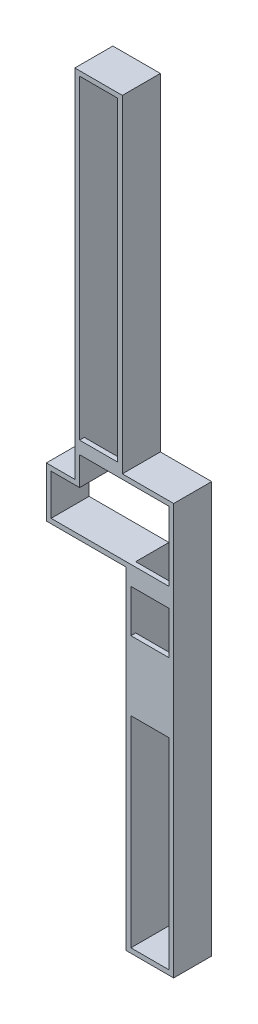
ISO-10303-21;
HEADER;
FILE_DESCRIPTION(('STEP AP214'),'2;1');
FILE_NAME('part.step','',(''),(''),'','','');
FILE_SCHEMA(('AUTOMOTIVE_DESIGN { 1 0 10303 214 1 1 1 1 }'));
ENDSEC;
DATA;
#1=APPLICATION_CONTEXT('core data for automotive mechanical design processes');
#2=APPLICATION_PROTOCOL_DEFINITION('international standard','automotive_design',2000,#1);
#3=PRODUCT_CONTEXT('',#1,'mechanical');
#4=PRODUCT('Part','Part','',(#3));
#5=PRODUCT_RELATED_PRODUCT_CATEGORY('part','',(#4));
#6=PRODUCT_DEFINITION_FORMATION('','',#4);
#7=PRODUCT_DEFINITION_CONTEXT('part definition',#1,'design');
#8=PRODUCT_DEFINITION('design','',#6,#7);
#9=PRODUCT_DEFINITION_SHAPE('','',#8);
#10=(LENGTH_UNIT() NAMED_UNIT(*) SI_UNIT(.MILLI.,.METRE.));
#11=(NAMED_UNIT(*) PLANE_ANGLE_UNIT() SI_UNIT($,.RADIAN.));
#12=(NAMED_UNIT(*) SI_UNIT($,.STERADIAN.) SOLID_ANGLE_UNIT());
#13=UNCERTAINTY_MEASURE_WITH_UNIT(LENGTH_MEASURE(1.E-05),#10,'distance_accuracy_value','');
#14=(GEOMETRIC_REPRESENTATION_CONTEXT(3) GLOBAL_UNCERTAINTY_ASSIGNED_CONTEXT((#13)) GLOBAL_UNIT_ASSIGNED_CONTEXT((#10,
#11,#12)) REPRESENTATION_CONTEXT('',''));
#15=CARTESIAN_POINT('',(0.,0.,0.));
#16=DIRECTION('',(0.,0.,1.));
#17=DIRECTION('',(1.,0.,0.));
#18=AXIS2_PLACEMENT_3D('',#15,#16,#17);
#19=CARTESIAN_POINT('',(0.,0.,800.));
#20=DIRECTION('',(0.,0.,1.));
#21=DIRECTION('',(1.,0.,0.));
#22=AXIS2_PLACEMENT_3D('',#19,#20,#21);
#23=PLANE('',#22);
#24=DIRECTION('',(0.,1.,0.));
#25=VECTOR('',#24,1.);
#26=CARTESIAN_POINT('',(526.453179541659,7500.,800.));
#27=LINE('',#26,#25);
#28=CARTESIAN_POINT('',(526.45317954166,865.,800.));
#29=VERTEX_POINT('',#28);
#30=CARTESIAN_POINT('',(526.453179541659,7500.,800.));
#31=VERTEX_POINT('',#30);
#32=EDGE_CURVE('E231',#29,#31,#27,.T.);
#33=ORIENTED_EDGE('',*,*,#32,.F.);
#34=DIRECTION('',(-1.,0.,0.));
#35=VECTOR('',#34,1.);
#36=CARTESIAN_POINT('',(-273.546820458341,865.,800.));
#37=LINE('',#36,#35);
#38=CARTESIAN_POINT('',(-273.546820458341,865.,800.));
#39=VERTEX_POINT('',#38);
#40=EDGE_CURVE('E235',#29,#39,#37,.T.);
#41=ORIENTED_EDGE('',*,*,#40,.T.);
#42=DIRECTION('',(0.,-1.,0.));
#43=VECTOR('',#42,1.);
#44=CARTESIAN_POINT('',(-273.546820458341,0.,800.));
#45=LINE('',#44,#43);
#46=CARTESIAN_POINT('',(-273.546820458341,7500.,800.));
#47=VERTEX_POINT('',#46);
#48=EDGE_CURVE('E331',#47,#39,#45,.T.);
#49=ORIENTED_EDGE('',*,*,#48,.F.);
#50=DIRECTION('',(-1.,0.,0.));
#51=VECTOR('',#50,1.);
#52=CARTESIAN_POINT('',(-273.546820458341,7500.,800.));
#53=LINE('',#52,#51);
#54=EDGE_CURVE('E237',#31,#47,#53,.T.);
#55=ORIENTED_EDGE('',*,*,#54,.F.);
#56=EDGE_LOOP('',(#33,#41,#49,#55));
#57=FACE_BOUND('',#56,.T.);
#58=DIRECTION('',(0.,-1.,0.));
#59=VECTOR('',#58,1.);
#60=CARTESIAN_POINT('',(806.45317954166,-860.,800.));
#61=LINE('',#60,#59);
#62=CARTESIAN_POINT('',(806.453179541661,-3618.33978235796,800.));
#63=VERTEX_POINT('',#62);
#64=CARTESIAN_POINT('',(806.453179541661,-7850.,800.));
#65=VERTEX_POINT('',#64);
#66=EDGE_CURVE('E319',#63,#65,#61,.T.);
#67=ORIENTED_EDGE('',*,*,#66,.F.);
#68=DIRECTION('',(1.,0.,0.));
#69=VECTOR('',#68,1.);
#70=CARTESIAN_POINT('',(1606.45317954166,-3618.33978235796,800.));
#71=LINE('',#70,#69);
#72=CARTESIAN_POINT('',(1606.45317954166,-3618.33978235797,800.));
#73=VERTEX_POINT('',#72);
#74=EDGE_CURVE('E260',#63,#73,#71,.T.);
#75=ORIENTED_EDGE('',*,*,#74,.T.);
#76=DIRECTION('',(0.,1.,0.));
#77=VECTOR('',#76,1.);
#78=CARTESIAN_POINT('',(1606.45317954166,-7850.,800.));
#79=LINE('',#78,#77);
#80=CARTESIAN_POINT('',(1606.45317954166,-7850.,800.));
#81=VERTEX_POINT('',#80);
#82=EDGE_CURVE('E325',#81,#73,#79,.T.);
#83=ORIENTED_EDGE('',*,*,#82,.F.);
#84=DIRECTION('',(1.,0.,0.));
#85=VECTOR('',#84,1.);
#86=CARTESIAN_POINT('',(806.453179541661,-7850.,800.));
#87=LINE('',#86,#85);
#88=EDGE_CURVE('E322',#65,#81,#87,.T.);
#89=ORIENTED_EDGE('',*,*,#88,.F.);
#90=EDGE_LOOP('',(#67,#75,#83,#89));
#91=FACE_BOUND('',#90,.T.);
#92=CARTESIAN_POINT('',(806.45317954166,-1260.,800.));
#93=VERTEX_POINT('',#92);
#94=CARTESIAN_POINT('',(806.45317954166,-2160.,800.));
#95=VERTEX_POINT('',#94);
#96=EDGE_CURVE('E320',#93,#95,#61,.T.);
#97=ORIENTED_EDGE('',*,*,#96,.F.);
#98=DIRECTION('',(1.,0.,0.));
#99=VECTOR('',#98,1.);
#100=CARTESIAN_POINT('',(1606.45317954166,-1260.,800.));
#101=LINE('',#100,#99);
#102=CARTESIAN_POINT('',(1606.45317954166,-1260.,800.));
#103=VERTEX_POINT('',#102);
#104=EDGE_CURVE('E281',#93,#103,#101,.T.);
#105=ORIENTED_EDGE('',*,*,#104,.T.);
#106=CARTESIAN_POINT('',(1606.45317954166,-2160.,800.));
#107=VERTEX_POINT('',#106);
#108=EDGE_CURVE('E327',#107,#103,#79,.T.);
#109=ORIENTED_EDGE('',*,*,#108,.F.);
#110=DIRECTION('',(-1.,0.,0.));
#111=VECTOR('',#110,1.);
#112=CARTESIAN_POINT('',(806.45317954166,-2160.,800.));
#113=LINE('',#112,#111);
#114=EDGE_CURVE('E265',#107,#95,#113,.T.);
#115=ORIENTED_EDGE('',*,*,#114,.T.);
#116=EDGE_LOOP('',(#97,#105,#109,#115));
#117=FACE_BOUND('',#116,.T.);
#118=DIRECTION('',(1.,0.,0.));
#119=VECTOR('',#118,1.);
#120=CARTESIAN_POINT('',(706.453179541661,-7950.,800.));
#121=LINE('',#120,#119);
#122=CARTESIAN_POINT('',(706.453179541661,-7950.,800.));
#123=VERTEX_POINT('',#122);
#124=CARTESIAN_POINT('',(1706.45317954166,-7950.,800.));
#125=VERTEX_POINT('',#124);
#126=EDGE_CURVE('E385',#123,#125,#121,.T.);
#127=ORIENTED_EDGE('',*,*,#126,.T.);
#128=DIRECTION('',(0.,1.,0.));
#129=VECTOR('',#128,1.);
#130=CARTESIAN_POINT('',(1706.45317954166,-7950.,800.));
#131=LINE('',#130,#129);
#132=CARTESIAN_POINT('',(1706.45317954166,700.,800.));
#133=VERTEX_POINT('',#132);
#134=EDGE_CURVE('E387',#125,#133,#131,.T.);
#135=ORIENTED_EDGE('',*,*,#134,.T.);
#136=DIRECTION('',(-1.,0.,0.));
#137=VECTOR('',#136,1.);
#138=CARTESIAN_POINT('',(1706.45317954166,700.,800.));
#139=LINE('',#138,#137);
#140=CARTESIAN_POINT('',(626.45317954166,700.,800.));
#141=VERTEX_POINT('',#140);
#142=EDGE_CURVE('E390',#133,#141,#139,.T.);
#143=ORIENTED_EDGE('',*,*,#142,.T.);
#144=DIRECTION('',(0.,1.,0.));
#145=VECTOR('',#144,1.);
#146=CARTESIAN_POINT('',(626.45317954166,700.,800.));
#147=LINE('',#146,#145);
#148=CARTESIAN_POINT('',(626.45317954166,7600.,800.));
#149=VERTEX_POINT('',#148);
#150=EDGE_CURVE('E392',#141,#149,#147,.T.);
#151=ORIENTED_EDGE('',*,*,#150,.T.);
#152=DIRECTION('',(-1.,0.,0.));
#153=VECTOR('',#152,1.);
#154=CARTESIAN_POINT('',(626.45317954166,7600.,800.));
#155=LINE('',#154,#153);
#156=CARTESIAN_POINT('',(-373.546820458341,7600.,800.));
#157=VERTEX_POINT('',#156);
#158=EDGE_CURVE('E394',#149,#157,#155,.T.);
#159=ORIENTED_EDGE('',*,*,#158,.T.);
#160=DIRECTION('',(0.,-1.,0.));
#161=VECTOR('',#160,1.);
#162=CARTESIAN_POINT('',(-373.546820458341,7600.,800.));
#163=LINE('',#162,#161);
#164=CARTESIAN_POINT('',(-373.54682045834,100.,800.));
#165=VERTEX_POINT('',#164);
#166=EDGE_CURVE('E396',#157,#165,#163,.T.);
#167=ORIENTED_EDGE('',*,*,#166,.T.);
#168=DIRECTION('',(-1.,0.,0.));
#169=VECTOR('',#168,1.);
#170=CARTESIAN_POINT('',(-973.54682045834,100.,800.));
#171=LINE('',#170,#169);
#172=CARTESIAN_POINT('',(-973.54682045834,100.,800.));
#173=VERTEX_POINT('',#172);
#174=EDGE_CURVE('E398',#165,#173,#171,.T.);
#175=ORIENTED_EDGE('',*,*,#174,.T.);
#176=DIRECTION('',(0.,-1.,0.));
#177=VECTOR('',#176,1.);
#178=CARTESIAN_POINT('',(-973.54682045834,-960.,800.));
#179=LINE('',#178,#177);
#180=CARTESIAN_POINT('',(-973.54682045834,-960.,800.));
#181=VERTEX_POINT('',#180);
#182=EDGE_CURVE('E400',#173,#181,#179,.T.);
#183=ORIENTED_EDGE('',*,*,#182,.T.);
#184=DIRECTION('',(1.,0.,0.));
#185=VECTOR('',#184,1.);
#186=CARTESIAN_POINT('',(706.45317954166,-960.,800.));
#187=LINE('',#186,#185);
#188=CARTESIAN_POINT('',(706.45317954166,-960.,800.));
#189=VERTEX_POINT('',#188);
#190=EDGE_CURVE('E402',#181,#189,#187,.T.);
#191=ORIENTED_EDGE('',*,*,#190,.T.);
#192=DIRECTION('',(0.,-1.,0.));
#193=VECTOR('',#192,1.);
#194=CARTESIAN_POINT('',(706.45317954166,-960.,800.));
#195=LINE('',#194,#193);
#196=EDGE_CURVE('E404',#189,#123,#195,.T.);
#197=ORIENTED_EDGE('',*,*,#196,.T.);
#198=EDGE_LOOP('',(#127,#135,#143,#151,#159,#167,#175,#183,#191,#197));
#199=FACE_BOUND('',#198,.T.);
#200=DIRECTION('',(0.,-1.,0.));
#201=VECTOR('',#200,1.);
#202=CARTESIAN_POINT('',(-873.546820458341,0.,800.));
#203=LINE('',#202,#201);
#204=CARTESIAN_POINT('',(-873.546820458341,0.,800.));
#205=VERTEX_POINT('',#204);
#206=CARTESIAN_POINT('',(-873.546820458341,-860.,800.));
#207=VERTEX_POINT('',#206);
#208=EDGE_CURVE('E314',#205,#207,#203,.T.);
#209=ORIENTED_EDGE('',*,*,#208,.F.);
#210=DIRECTION('',(-1.,0.,0.));
#211=VECTOR('',#210,1.);
#212=CARTESIAN_POINT('',(-273.546820458341,0.,800.));
#213=LINE('',#212,#211);
#214=CARTESIAN_POINT('',(-273.546820458341,0.,800.));
#215=VERTEX_POINT('',#214);
#216=EDGE_CURVE('E312',#215,#205,#213,.T.);
#217=ORIENTED_EDGE('',*,*,#216,.F.);
#218=CARTESIAN_POINT('',(-273.546820458341,600.,800.));
#219=VERTEX_POINT('',#218);
#220=EDGE_CURVE('E330',#219,#215,#45,.T.);
#221=ORIENTED_EDGE('',*,*,#220,.F.);
#222=DIRECTION('',(-1.,0.,0.));
#223=VECTOR('',#222,1.);
#224=CARTESIAN_POINT('',(1606.45317954166,600.,800.));
#225=LINE('',#224,#223);
#226=CARTESIAN_POINT('',(1606.45317954166,600.,800.));
#227=VERTEX_POINT('',#226);
#228=EDGE_CURVE('E239',#227,#219,#225,.T.);
#229=ORIENTED_EDGE('',*,*,#228,.F.);
#230=CARTESIAN_POINT('',(1606.45317954166,-860.,800.));
#231=VERTEX_POINT('',#230);
#232=EDGE_CURVE('E324',#231,#227,#79,.T.);
#233=ORIENTED_EDGE('',*,*,#232,.F.);
#234=DIRECTION('',(1.,0.,0.));
#235=VECTOR('',#234,1.);
#236=CARTESIAN_POINT('',(-873.546820458341,-860.,800.));
#237=LINE('',#236,#235);
#238=EDGE_CURVE('E317',#207,#231,#237,.T.);
#239=ORIENTED_EDGE('',*,*,#238,.F.);
#240=EDGE_LOOP('',(#209,#217,#221,#229,#233,#239));
#241=FACE_BOUND('',#240,.T.);
#242=ADVANCED_FACE('F35',(#57,#91,#117,#199,#241),#23,.T.);
#243=CARTESIAN_POINT('',(0.,0.,0.));
#244=DIRECTION('',(0.,0.,1.));
#245=DIRECTION('',(1.,0.,0.));
#246=AXIS2_PLACEMENT_3D('',#243,#244,#245);
#247=PLANE('',#246);
#248=DIRECTION('',(1.,0.,0.));
#249=VECTOR('',#248,1.);
#250=CARTESIAN_POINT('',(1606.45317954166,-7950.,0.));
#251=LINE('',#250,#249);
#252=CARTESIAN_POINT('',(706.453179541661,-7950.,0.));
#253=VERTEX_POINT('',#252);
#254=CARTESIAN_POINT('',(1706.45317954166,-7950.,0.));
#255=VERTEX_POINT('',#254);
#256=EDGE_CURVE('E384',#253,#255,#251,.T.);
#257=ORIENTED_EDGE('',*,*,#256,.F.);
#258=DIRECTION('',(0.,-1.,0.));
#259=VECTOR('',#258,1.);
#260=CARTESIAN_POINT('',(706.45317954166,-960.,0.));
#261=LINE('',#260,#259);
#262=CARTESIAN_POINT('',(706.45317954166,-960.,0.));
#263=VERTEX_POINT('',#262);
#264=EDGE_CURVE('E388',#263,#253,#261,.T.);
#265=ORIENTED_EDGE('',*,*,#264,.F.);
#266=DIRECTION('',(1.,0.,0.));
#267=VECTOR('',#266,1.);
#268=CARTESIAN_POINT('',(706.45317954166,-960.,0.));
#269=LINE('',#268,#267);
#270=CARTESIAN_POINT('',(-973.54682045834,-960.,0.));
#271=VERTEX_POINT('',#270);
#272=EDGE_CURVE('E423',#271,#263,#269,.T.);
#273=ORIENTED_EDGE('',*,*,#272,.F.);
#274=DIRECTION('',(0.,-1.,0.));
#275=VECTOR('',#274,1.);
#276=CARTESIAN_POINT('',(-973.54682045834,-960.,0.));
#277=LINE('',#276,#275);
#278=CARTESIAN_POINT('',(-973.54682045834,100.,0.));
#279=VERTEX_POINT('',#278);
#280=EDGE_CURVE('E421',#279,#271,#277,.T.);
#281=ORIENTED_EDGE('',*,*,#280,.F.);
#282=DIRECTION('',(-1.,0.,0.));
#283=VECTOR('',#282,1.);
#284=CARTESIAN_POINT('',(-973.54682045834,100.,0.));
#285=LINE('',#284,#283);
#286=CARTESIAN_POINT('',(-373.54682045834,100.,0.));
#287=VERTEX_POINT('',#286);
#288=EDGE_CURVE('E419',#287,#279,#285,.T.);
#289=ORIENTED_EDGE('',*,*,#288,.F.);
#290=DIRECTION('',(0.,-1.,0.));
#291=VECTOR('',#290,1.);
#292=CARTESIAN_POINT('',(-373.546820458341,7600.,0.));
#293=LINE('',#292,#291);
#294=CARTESIAN_POINT('',(-373.546820458341,7600.,0.));
#295=VERTEX_POINT('',#294);
#296=EDGE_CURVE('E417',#295,#287,#293,.T.);
#297=ORIENTED_EDGE('',*,*,#296,.F.);
#298=DIRECTION('',(-1.,0.,0.));
#299=VECTOR('',#298,1.);
#300=CARTESIAN_POINT('',(626.45317954166,7600.,0.));
#301=LINE('',#300,#299);
#302=CARTESIAN_POINT('',(626.45317954166,7600.,0.));
#303=VERTEX_POINT('',#302);
#304=EDGE_CURVE('E415',#303,#295,#301,.T.);
#305=ORIENTED_EDGE('',*,*,#304,.F.);
#306=DIRECTION('',(0.,1.,0.));
#307=VECTOR('',#306,1.);
#308=CARTESIAN_POINT('',(626.45317954166,700.,0.));
#309=LINE('',#308,#307);
#310=CARTESIAN_POINT('',(626.45317954166,700.,0.));
#311=VERTEX_POINT('',#310);
#312=EDGE_CURVE('E413',#311,#303,#309,.T.);
#313=ORIENTED_EDGE('',*,*,#312,.F.);
#314=DIRECTION('',(-1.,0.,0.));
#315=VECTOR('',#314,1.);
#316=CARTESIAN_POINT('',(1706.45317954166,700.,0.));
#317=LINE('',#316,#315);
#318=CARTESIAN_POINT('',(1706.45317954166,700.,0.));
#319=VERTEX_POINT('',#318);
#320=EDGE_CURVE('E411',#319,#311,#317,.T.);
#321=ORIENTED_EDGE('',*,*,#320,.F.);
#322=DIRECTION('',(0.,1.,0.));
#323=VECTOR('',#322,1.);
#324=CARTESIAN_POINT('',(1706.45317954166,599.648210299355,0.));
#325=LINE('',#324,#323);
#326=EDGE_CURVE('E409',#255,#319,#325,.T.);
#327=ORIENTED_EDGE('',*,*,#326,.F.);
#328=EDGE_LOOP('',(#257,#265,#273,#281,#289,#297,#305,#313,#321,#327));
#329=FACE_BOUND('',#328,.T.);
#330=DIRECTION('',(-1.,0.,0.));
#331=VECTOR('',#330,1.);
#332=CARTESIAN_POINT('',(-273.546820458341,0.,0.));
#333=LINE('',#332,#331);
#334=CARTESIAN_POINT('',(-273.546820458341,0.,0.));
#335=VERTEX_POINT('',#334);
#336=CARTESIAN_POINT('',(-873.546820458341,0.,0.));
#337=VERTEX_POINT('',#336);
#338=EDGE_CURVE('E306',#335,#337,#333,.T.);
#339=ORIENTED_EDGE('',*,*,#338,.T.);
#340=DIRECTION('',(0.,-1.,0.));
#341=VECTOR('',#340,1.);
#342=CARTESIAN_POINT('',(-873.546820458341,0.,0.));
#343=LINE('',#342,#341);
#344=CARTESIAN_POINT('',(-873.546820458341,-860.,0.));
#345=VERTEX_POINT('',#344);
#346=EDGE_CURVE('E336',#337,#345,#343,.T.);
#347=ORIENTED_EDGE('',*,*,#346,.T.);
#348=DIRECTION('',(1.,0.,0.));
#349=VECTOR('',#348,1.);
#350=CARTESIAN_POINT('',(-373.54682045834,-860.,0.));
#351=LINE('',#350,#349);
#352=CARTESIAN_POINT('',(806.45317954166,-860.,0.));
#353=VERTEX_POINT('',#352);
#354=EDGE_CURVE('E339',#345,#353,#351,.T.);
#355=ORIENTED_EDGE('',*,*,#354,.T.);
#356=DIRECTION('',(0.,-1.,0.));
#357=VECTOR('',#356,1.);
#358=CARTESIAN_POINT('',(806.45317954166,-860.,0.));
#359=LINE('',#358,#357);
#360=CARTESIAN_POINT('',(806.453179541661,-7850.,0.));
#361=VERTEX_POINT('',#360);
#362=EDGE_CURVE('E342',#353,#361,#359,.T.);
#363=ORIENTED_EDGE('',*,*,#362,.T.);
#364=DIRECTION('',(1.,0.,0.));
#365=VECTOR('',#364,1.);
#366=CARTESIAN_POINT('',(806.453179541661,-7850.,0.));
#367=LINE('',#366,#365);
#368=CARTESIAN_POINT('',(1606.45317954166,-7850.,0.));
#369=VERTEX_POINT('',#368);
#370=EDGE_CURVE('E345',#361,#369,#367,.T.);
#371=ORIENTED_EDGE('',*,*,#370,.T.);
#372=DIRECTION('',(0.,1.,0.));
#373=VECTOR('',#372,1.);
#374=CARTESIAN_POINT('',(1606.45317954166,499.648210299355,0.));
#375=LINE('',#374,#373);
#376=CARTESIAN_POINT('',(1606.45317954166,600.,0.));
#377=VERTEX_POINT('',#376);
#378=EDGE_CURVE('E348',#369,#377,#375,.T.);
#379=ORIENTED_EDGE('',*,*,#378,.T.);
#380=DIRECTION('',(-1.,0.,0.));
#381=VECTOR('',#380,1.);
#382=CARTESIAN_POINT('',(1606.45317954166,600.,0.));
#383=LINE('',#382,#381);
#384=CARTESIAN_POINT('',(526.45317954166,600.,0.));
#385=VERTEX_POINT('',#384);
#386=EDGE_CURVE('E351',#377,#385,#383,.T.);
#387=ORIENTED_EDGE('',*,*,#386,.T.);
#388=DIRECTION('',(0.,1.,0.));
#389=VECTOR('',#388,1.);
#390=CARTESIAN_POINT('',(526.453179541659,7500.,0.));
#391=LINE('',#390,#389);
#392=CARTESIAN_POINT('',(526.453179541659,7500.,0.));
#393=VERTEX_POINT('',#392);
#394=EDGE_CURVE('E354',#385,#393,#391,.T.);
#395=ORIENTED_EDGE('',*,*,#394,.T.);
#396=DIRECTION('',(-1.,0.,0.));
#397=VECTOR('',#396,1.);
#398=CARTESIAN_POINT('',(-273.546820458341,7500.,0.));
#399=LINE('',#398,#397);
#400=CARTESIAN_POINT('',(-273.546820458341,7500.,0.));
#401=VERTEX_POINT('',#400);
#402=EDGE_CURVE('E357',#393,#401,#399,.T.);
#403=ORIENTED_EDGE('',*,*,#402,.T.);
#404=DIRECTION('',(0.,-1.,0.));
#405=VECTOR('',#404,1.);
#406=CARTESIAN_POINT('',(-273.546820458341,0.,0.));
#407=LINE('',#406,#405);
#408=EDGE_CURVE('E315',#401,#335,#407,.T.);
#409=ORIENTED_EDGE('',*,*,#408,.T.);
#410=EDGE_LOOP('',(#339,#347,#355,#363,#371,#379,#387,#395,#403,#409));
#411=FACE_BOUND('',#410,.T.);
#412=ADVANCED_FACE('F460',(#329,#411),#247,.F.);
#413=CARTESIAN_POINT('',(1606.45317954166,-7950.,800.));
#414=DIRECTION('',(0.,1.,0.));
#415=DIRECTION('',(0.,0.,1.));
#416=AXIS2_PLACEMENT_3D('',#413,#414,#415);
#417=PLANE('',#416);
#418=ORIENTED_EDGE('',*,*,#256,.T.);
#419=DIRECTION('',(0.,0.,-1.));
#420=VECTOR('',#419,1.);
#421=CARTESIAN_POINT('',(1706.45317954166,-7950.,800.));
#422=LINE('',#421,#420);
#423=EDGE_CURVE('E11',#125,#255,#422,.T.);
#424=ORIENTED_EDGE('',*,*,#423,.F.);
#425=ORIENTED_EDGE('',*,*,#126,.F.);
#426=DIRECTION('',(0.,0.,-1.));
#427=VECTOR('',#426,1.);
#428=CARTESIAN_POINT('',(706.453179541661,-7950.,800.));
#429=LINE('',#428,#427);
#430=EDGE_CURVE('E406',#123,#253,#429,.T.);
#431=ORIENTED_EDGE('',*,*,#430,.T.);
#432=EDGE_LOOP('',(#418,#424,#425,#431));
#433=FACE_BOUND('',#432,.T.);
#434=ADVANCED_FACE('F37',(#433),#417,.F.);
#435=CARTESIAN_POINT('',(1706.45317954166,599.648210299355,800.));
#436=DIRECTION('',(-1.,0.,0.));
#437=DIRECTION('',(0.,0.,1.));
#438=AXIS2_PLACEMENT_3D('',#435,#436,#437);
#439=PLANE('',#438);
#440=ORIENTED_EDGE('',*,*,#326,.T.);
#441=DIRECTION('',(0.,0.,-1.));
#442=VECTOR('',#441,1.);
#443=CARTESIAN_POINT('',(1706.45317954166,700.,800.));
#444=LINE('',#443,#442);
#445=EDGE_CURVE('E43',#133,#319,#444,.T.);
#446=ORIENTED_EDGE('',*,*,#445,.F.);
#447=ORIENTED_EDGE('',*,*,#134,.F.);
#448=ORIENTED_EDGE('',*,*,#423,.T.);
#449=EDGE_LOOP('',(#440,#446,#447,#448));
#450=FACE_BOUND('',#449,.T.);
#451=ADVANCED_FACE('F478',(#450),#439,.F.);
#452=CARTESIAN_POINT('',(1706.45317954166,700.,800.));
#453=DIRECTION('',(0.,-1.,0.));
#454=DIRECTION('',(1.,0.,0.));
#455=AXIS2_PLACEMENT_3D('',#452,#453,#454);
#456=PLANE('',#455);
#457=ORIENTED_EDGE('',*,*,#320,.T.);
#458=DIRECTION('',(0.,0.,-1.));
#459=VECTOR('',#458,1.);
#460=CARTESIAN_POINT('',(626.45317954166,700.,800.));
#461=LINE('',#460,#459);
#462=EDGE_CURVE('E447',#141,#311,#461,.T.);
#463=ORIENTED_EDGE('',*,*,#462,.F.);
#464=ORIENTED_EDGE('',*,*,#142,.F.);
#465=ORIENTED_EDGE('',*,*,#445,.T.);
#466=EDGE_LOOP('',(#457,#463,#464,#465));
#467=FACE_BOUND('',#466,.T.);
#468=ADVANCED_FACE('F454',(#467),#456,.F.);
#469=CARTESIAN_POINT('',(626.45317954166,700.,800.));
#470=DIRECTION('',(-1.,0.,0.));
#471=DIRECTION('',(0.,-1.,0.));
#472=AXIS2_PLACEMENT_3D('',#469,#470,#471);
#473=PLANE('',#472);
#474=ORIENTED_EDGE('',*,*,#312,.T.);
#475=DIRECTION('',(0.,0.,-1.));
#476=VECTOR('',#475,1.);
#477=CARTESIAN_POINT('',(626.45317954166,7600.,800.));
#478=LINE('',#477,#476);
#479=EDGE_CURVE('E444',#149,#303,#478,.T.);
#480=ORIENTED_EDGE('',*,*,#479,.F.);
#481=ORIENTED_EDGE('',*,*,#150,.F.);
#482=ORIENTED_EDGE('',*,*,#462,.T.);
#483=EDGE_LOOP('',(#474,#480,#481,#482));
#484=FACE_BOUND('',#483,.T.);
#485=ADVANCED_FACE('F466',(#484),#473,.F.);
#486=CARTESIAN_POINT('',(626.45317954166,7600.,800.));
#487=DIRECTION('',(0.,-1.,0.));
#488=DIRECTION('',(0.,0.,-1.));
#489=AXIS2_PLACEMENT_3D('',#486,#487,#488);
#490=PLANE('',#489);
#491=ORIENTED_EDGE('',*,*,#304,.T.);
#492=DIRECTION('',(0.,0.,-1.));
#493=VECTOR('',#492,1.);
#494=CARTESIAN_POINT('',(-373.546820458341,7600.,800.));
#495=LINE('',#494,#493);
#496=EDGE_CURVE('E441',#157,#295,#495,.T.);
#497=ORIENTED_EDGE('',*,*,#496,.F.);
#498=ORIENTED_EDGE('',*,*,#158,.F.);
#499=ORIENTED_EDGE('',*,*,#479,.T.);
#500=EDGE_LOOP('',(#491,#497,#498,#499));
#501=FACE_BOUND('',#500,.T.);
#502=ADVANCED_FACE('F470',(#501),#490,.F.);
#503=CARTESIAN_POINT('',(-373.546820458341,7600.,800.));
#504=DIRECTION('',(1.,0.,0.));
#505=DIRECTION('',(0.,1.,0.));
#506=AXIS2_PLACEMENT_3D('',#503,#504,#505);
#507=PLANE('',#506);
#508=ORIENTED_EDGE('',*,*,#296,.T.);
#509=DIRECTION('',(0.,0.,-1.));
#510=VECTOR('',#509,1.);
#511=CARTESIAN_POINT('',(-373.54682045834,100.,800.));
#512=LINE('',#511,#510);
#513=EDGE_CURVE('E438',#165,#287,#512,.T.);
#514=ORIENTED_EDGE('',*,*,#513,.F.);
#515=ORIENTED_EDGE('',*,*,#166,.F.);
#516=ORIENTED_EDGE('',*,*,#496,.T.);
#517=EDGE_LOOP('',(#508,#514,#515,#516));
#518=FACE_BOUND('',#517,.T.);
#519=ADVANCED_FACE('F501',(#518),#507,.F.);
#520=CARTESIAN_POINT('',(-973.54682045834,100.,800.));
#521=DIRECTION('',(0.,-1.,0.));
#522=DIRECTION('',(1.,0.,0.));
#523=AXIS2_PLACEMENT_3D('',#520,#521,#522);
#524=PLANE('',#523);
#525=ORIENTED_EDGE('',*,*,#288,.T.);
#526=DIRECTION('',(0.,0.,-1.));
#527=VECTOR('',#526,1.);
#528=CARTESIAN_POINT('',(-973.54682045834,100.,800.));
#529=LINE('',#528,#527);
#530=EDGE_CURVE('E435',#173,#279,#529,.T.);
#531=ORIENTED_EDGE('',*,*,#530,.F.);
#532=ORIENTED_EDGE('',*,*,#174,.F.);
#533=ORIENTED_EDGE('',*,*,#513,.T.);
#534=EDGE_LOOP('',(#525,#531,#532,#533));
#535=FACE_BOUND('',#534,.T.);
#536=ADVANCED_FACE('F499',(#535),#524,.F.);
#537=CARTESIAN_POINT('',(-973.54682045834,-960.,800.));
#538=DIRECTION('',(1.,0.,0.));
#539=DIRECTION('',(0.,0.,-1.));
#540=AXIS2_PLACEMENT_3D('',#537,#538,#539);
#541=PLANE('',#540);
#542=ORIENTED_EDGE('',*,*,#280,.T.);
#543=DIRECTION('',(0.,0.,-1.));
#544=VECTOR('',#543,1.);
#545=CARTESIAN_POINT('',(-973.54682045834,-960.,800.));
#546=LINE('',#545,#544);
#547=EDGE_CURVE('E432',#181,#271,#546,.T.);
#548=ORIENTED_EDGE('',*,*,#547,.F.);
#549=ORIENTED_EDGE('',*,*,#182,.F.);
#550=ORIENTED_EDGE('',*,*,#530,.T.);
#551=EDGE_LOOP('',(#542,#548,#549,#550));
#552=FACE_BOUND('',#551,.T.);
#553=ADVANCED_FACE('F494',(#552),#541,.F.);
#554=CARTESIAN_POINT('',(706.45317954166,-960.,800.));
#555=DIRECTION('',(0.,1.,0.));
#556=DIRECTION('',(0.,0.,1.));
#557=AXIS2_PLACEMENT_3D('',#554,#555,#556);
#558=PLANE('',#557);
#559=ORIENTED_EDGE('',*,*,#272,.T.);
#560=DIRECTION('',(0.,0.,-1.));
#561=VECTOR('',#560,1.);
#562=CARTESIAN_POINT('',(706.45317954166,-960.,800.));
#563=LINE('',#562,#561);
#564=EDGE_CURVE('E429',#189,#263,#563,.T.);
#565=ORIENTED_EDGE('',*,*,#564,.F.);
#566=ORIENTED_EDGE('',*,*,#190,.F.);
#567=ORIENTED_EDGE('',*,*,#547,.T.);
#568=EDGE_LOOP('',(#559,#565,#566,#567));
#569=FACE_BOUND('',#568,.T.);
#570=ADVANCED_FACE('F489',(#569),#558,.F.);
#571=CARTESIAN_POINT('',(706.45317954166,-960.,800.));
#572=DIRECTION('',(1.,0.,0.));
#573=DIRECTION('',(0.,1.,0.));
#574=AXIS2_PLACEMENT_3D('',#571,#572,#573);
#575=PLANE('',#574);
#576=ORIENTED_EDGE('',*,*,#264,.T.);
#577=ORIENTED_EDGE('',*,*,#430,.F.);
#578=ORIENTED_EDGE('',*,*,#196,.F.);
#579=ORIENTED_EDGE('',*,*,#564,.T.);
#580=EDGE_LOOP('',(#576,#577,#578,#579));
#581=FACE_BOUND('',#580,.T.);
#582=ADVANCED_FACE('F484',(#581),#575,.F.);
#583=CARTESIAN_POINT('',(-273.546820458341,0.,800.));
#584=DIRECTION('',(0.,-1.,0.));
#585=DIRECTION('',(1.,0.,0.));
#586=AXIS2_PLACEMENT_3D('',#583,#584,#585);
#587=PLANE('',#586);
#588=ORIENTED_EDGE('',*,*,#338,.F.);
#589=DIRECTION('',(0.,0.,-1.));
#590=VECTOR('',#589,1.);
#591=CARTESIAN_POINT('',(-273.546820458341,0.,800.));
#592=LINE('',#591,#590);
#593=EDGE_CURVE('E333',#215,#335,#592,.T.);
#594=ORIENTED_EDGE('',*,*,#593,.F.);
#595=ORIENTED_EDGE('',*,*,#216,.T.);
#596=DIRECTION('',(0.,0.,-1.));
#597=VECTOR('',#596,1.);
#598=CARTESIAN_POINT('',(-873.546820458341,0.,800.));
#599=LINE('',#598,#597);
#600=EDGE_CURVE('E381',#205,#337,#599,.T.);
#601=ORIENTED_EDGE('',*,*,#600,.T.);
#602=EDGE_LOOP('',(#588,#594,#595,#601));
#603=FACE_BOUND('',#602,.T.);
#604=ADVANCED_FACE('F517',(#603),#587,.T.);
#605=CARTESIAN_POINT('',(-873.546820458341,0.,800.));
#606=DIRECTION('',(1.,0.,0.));
#607=DIRECTION('',(0.,0.,-1.));
#608=AXIS2_PLACEMENT_3D('',#605,#606,#607);
#609=PLANE('',#608);
#610=ORIENTED_EDGE('',*,*,#346,.F.);
#611=ORIENTED_EDGE('',*,*,#600,.F.);
#612=ORIENTED_EDGE('',*,*,#208,.T.);
#613=DIRECTION('',(0.,0.,-1.));
#614=VECTOR('',#613,1.);
#615=CARTESIAN_POINT('',(-873.546820458341,-860.,800.));
#616=LINE('',#615,#614);
#617=EDGE_CURVE('E378',#207,#345,#616,.T.);
#618=ORIENTED_EDGE('',*,*,#617,.T.);
#619=EDGE_LOOP('',(#610,#611,#612,#618));
#620=FACE_BOUND('',#619,.T.);
#621=ADVANCED_FACE('F543',(#620),#609,.T.);
#622=CARTESIAN_POINT('',(-373.54682045834,-860.,800.));
#623=DIRECTION('',(0.,1.,0.));
#624=DIRECTION('',(-1.,0.,0.));
#625=AXIS2_PLACEMENT_3D('',#622,#623,#624);
#626=PLANE('',#625);
#627=ORIENTED_EDGE('',*,*,#354,.F.);
#628=ORIENTED_EDGE('',*,*,#617,.F.);
#629=ORIENTED_EDGE('',*,*,#238,.T.);
#630=DIRECTION('',(0.,0.,1.));
#631=VECTOR('',#630,1.);
#632=CARTESIAN_POINT('',(1606.45317954166,-860.,700.));
#633=LINE('',#632,#631);
#634=CARTESIAN_POINT('',(1606.45317954167,-860.,700.));
#635=VERTEX_POINT('',#634);
#636=EDGE_CURVE('E303',#635,#231,#633,.T.);
#637=ORIENTED_EDGE('',*,*,#636,.F.);
#638=DIRECTION('',(-1.,0.,0.));
#639=VECTOR('',#638,1.);
#640=CARTESIAN_POINT('',(806.45317954166,-860.,700.));
#641=LINE('',#640,#639);
#642=CARTESIAN_POINT('',(806.45317954166,-860.,700.));
#643=VERTEX_POINT('',#642);
#644=EDGE_CURVE('E297',#635,#643,#641,.T.);
#645=ORIENTED_EDGE('',*,*,#644,.T.);
#646=DIRECTION('',(0.,0.,-1.));
#647=VECTOR('',#646,1.);
#648=CARTESIAN_POINT('',(806.45317954166,-860.,800.));
#649=LINE('',#648,#647);
#650=EDGE_CURVE('E376',#643,#353,#649,.T.);
#651=ORIENTED_EDGE('',*,*,#650,.T.);
#652=EDGE_LOOP('',(#627,#628,#629,#637,#645,#651));
#653=FACE_BOUND('',#652,.T.);
#654=ADVANCED_FACE('F550',(#653),#626,.T.);
#655=CARTESIAN_POINT('',(806.45317954166,-860.,800.));
#656=DIRECTION('',(1.,0.,0.));
#657=DIRECTION('',(0.,1.,0.));
#658=AXIS2_PLACEMENT_3D('',#655,#656,#657);
#659=PLANE('',#658);
#660=DIRECTION('',(0.,0.,1.));
#661=VECTOR('',#660,1.);
#662=CARTESIAN_POINT('',(806.45317954166,-2160.,700.));
#663=LINE('',#662,#661);
#664=CARTESIAN_POINT('',(806.45317954166,-2160.,700.));
#665=VERTEX_POINT('',#664);
#666=EDGE_CURVE('E278',#665,#95,#663,.T.);
#667=ORIENTED_EDGE('',*,*,#666,.F.);
#668=DIRECTION('',(0.,-1.,0.));
#669=VECTOR('',#668,1.);
#670=CARTESIAN_POINT('',(806.453179541661,-3618.33978235796,700.));
#671=LINE('',#670,#669);
#672=CARTESIAN_POINT('',(806.453179541661,-3618.33978235796,700.));
#673=VERTEX_POINT('',#672);
#674=EDGE_CURVE('E262',#665,#673,#671,.T.);
#675=ORIENTED_EDGE('',*,*,#674,.T.);
#676=DIRECTION('',(0.,0.,1.));
#677=VECTOR('',#676,1.);
#678=CARTESIAN_POINT('',(806.453179541661,-3618.33978235796,700.));
#679=LINE('',#678,#677);
#680=EDGE_CURVE('E273',#673,#63,#679,.T.);
#681=ORIENTED_EDGE('',*,*,#680,.T.);
#682=ORIENTED_EDGE('',*,*,#66,.T.);
#683=DIRECTION('',(0.,0.,-1.));
#684=VECTOR('',#683,1.);
#685=CARTESIAN_POINT('',(806.453179541661,-7850.,800.));
#686=LINE('',#685,#684);
#687=EDGE_CURVE('E374',#65,#361,#686,.T.);
#688=ORIENTED_EDGE('',*,*,#687,.T.);
#689=ORIENTED_EDGE('',*,*,#362,.F.);
#690=ORIENTED_EDGE('',*,*,#650,.F.);
#691=DIRECTION('',(0.,-1.,0.));
#692=VECTOR('',#691,1.);
#693=CARTESIAN_POINT('',(806.45317954166,-1260.,700.));
#694=LINE('',#693,#692);
#695=CARTESIAN_POINT('',(806.45317954166,-1260.,700.));
#696=VERTEX_POINT('',#695);
#697=EDGE_CURVE('E290',#643,#696,#694,.T.);
#698=ORIENTED_EDGE('',*,*,#697,.T.);
#699=DIRECTION('',(0.,0.,1.));
#700=VECTOR('',#699,1.);
#701=CARTESIAN_POINT('',(806.45317954166,-1260.,700.));
#702=LINE('',#701,#700);
#703=EDGE_CURVE('E300',#696,#93,#702,.T.);
#704=ORIENTED_EDGE('',*,*,#703,.T.);
#705=ORIENTED_EDGE('',*,*,#96,.T.);
#706=EDGE_LOOP('',(#667,#675,#681,#682,#688,#689,#690,#698,#704,#705));
#707=FACE_BOUND('',#706,.T.);
#708=ADVANCED_FACE('F558',(#707),#659,.T.);
#709=CARTESIAN_POINT('',(806.453179541661,-7850.,800.));
#710=DIRECTION('',(0.,1.,0.));
#711=DIRECTION('',(0.,0.,1.));
#712=AXIS2_PLACEMENT_3D('',#709,#710,#711);
#713=PLANE('',#712);
#714=ORIENTED_EDGE('',*,*,#370,.F.);
#715=ORIENTED_EDGE('',*,*,#687,.F.);
#716=ORIENTED_EDGE('',*,*,#88,.T.);
#717=DIRECTION('',(0.,0.,-1.));
#718=VECTOR('',#717,1.);
#719=CARTESIAN_POINT('',(1606.45317954166,-7850.,800.));
#720=LINE('',#719,#718);
#721=EDGE_CURVE('E371',#81,#369,#720,.T.);
#722=ORIENTED_EDGE('',*,*,#721,.T.);
#723=EDGE_LOOP('',(#714,#715,#716,#722));
#724=FACE_BOUND('',#723,.T.);
#725=ADVANCED_FACE('F568',(#724),#713,.T.);
#726=CARTESIAN_POINT('',(1606.45317954166,499.648210299355,800.));
#727=DIRECTION('',(-1.,0.,0.));
#728=DIRECTION('',(0.,-1.,0.));
#729=AXIS2_PLACEMENT_3D('',#726,#727,#728);
#730=PLANE('',#729);
#731=DIRECTION('',(0.,0.,1.));
#732=VECTOR('',#731,1.);
#733=CARTESIAN_POINT('',(1606.45317954166,-2160.,700.));
#734=LINE('',#733,#732);
#735=CARTESIAN_POINT('',(1606.45317954168,-2160.,700.));
#736=VERTEX_POINT('',#735);
#737=EDGE_CURVE('E282',#736,#107,#734,.T.);
#738=ORIENTED_EDGE('',*,*,#737,.T.);
#739=ORIENTED_EDGE('',*,*,#108,.T.);
#740=DIRECTION('',(0.,0.,1.));
#741=VECTOR('',#740,1.);
#742=CARTESIAN_POINT('',(1606.45317954166,-1260.,700.));
#743=LINE('',#742,#741);
#744=CARTESIAN_POINT('',(1606.45317954168,-1260.,700.));
#745=VERTEX_POINT('',#744);
#746=EDGE_CURVE('E307',#745,#103,#743,.T.);
#747=ORIENTED_EDGE('',*,*,#746,.F.);
#748=DIRECTION('',(0.,1.,0.));
#749=VECTOR('',#748,1.);
#750=CARTESIAN_POINT('',(1606.45317954166,-860.,700.));
#751=LINE('',#750,#749);
#752=EDGE_CURVE('E295',#745,#635,#751,.T.);
#753=ORIENTED_EDGE('',*,*,#752,.T.);
#754=ORIENTED_EDGE('',*,*,#636,.T.);
#755=ORIENTED_EDGE('',*,*,#232,.T.);
#756=DIRECTION('',(0.,0.,-1.));
#757=VECTOR('',#756,1.);
#758=CARTESIAN_POINT('',(1606.45317954166,600.,800.));
#759=LINE('',#758,#757);
#760=EDGE_CURVE('E369',#227,#377,#759,.T.);
#761=ORIENTED_EDGE('',*,*,#760,.T.);
#762=ORIENTED_EDGE('',*,*,#378,.F.);
#763=ORIENTED_EDGE('',*,*,#721,.F.);
#764=ORIENTED_EDGE('',*,*,#82,.T.);
#765=DIRECTION('',(0.,0.,1.));
#766=VECTOR('',#765,1.);
#767=CARTESIAN_POINT('',(1606.45317954166,-3618.33978235796,700.));
#768=LINE('',#767,#766);
#769=CARTESIAN_POINT('',(1606.4531795417,-3618.33978235796,700.));
#770=VERTEX_POINT('',#769);
#771=EDGE_CURVE('E285',#770,#73,#768,.T.);
#772=ORIENTED_EDGE('',*,*,#771,.F.);
#773=DIRECTION('',(0.,1.,0.));
#774=VECTOR('',#773,1.);
#775=CARTESIAN_POINT('',(1606.45317954166,-2160.,700.));
#776=LINE('',#775,#774);
#777=EDGE_CURVE('E268',#770,#736,#776,.T.);
#778=ORIENTED_EDGE('',*,*,#777,.T.);
#779=EDGE_LOOP('',(#738,#739,#747,#753,#754,#755,#761,#762,#763,#764,#772,#778));
#780=FACE_BOUND('',#779,.T.);
#781=ADVANCED_FACE('F577',(#780),#730,.T.);
#782=CARTESIAN_POINT('',(1606.45317954166,600.,800.));
#783=DIRECTION('',(0.,-1.,0.));
#784=DIRECTION('',(1.,0.,0.));
#785=AXIS2_PLACEMENT_3D('',#782,#783,#784);
#786=PLANE('',#785);
#787=ORIENTED_EDGE('',*,*,#386,.F.);
#788=ORIENTED_EDGE('',*,*,#760,.F.);
#789=ORIENTED_EDGE('',*,*,#228,.T.);
#790=DIRECTION('',(0.,0.,1.));
#791=VECTOR('',#790,1.);
#792=CARTESIAN_POINT('',(-273.546820458341,600.,700.));
#793=LINE('',#792,#791);
#794=CARTESIAN_POINT('',(-273.546820458341,600.,700.));
#795=VERTEX_POINT('',#794);
#796=EDGE_CURVE('E257',#795,#219,#793,.T.);
#797=ORIENTED_EDGE('',*,*,#796,.F.);
#798=DIRECTION('',(1.,0.,0.));
#799=VECTOR('',#798,1.);
#800=CARTESIAN_POINT('',(526.45317954166,600.,700.));
#801=LINE('',#800,#799);
#802=CARTESIAN_POINT('',(526.45317954166,600.,700.));
#803=VERTEX_POINT('',#802);
#804=EDGE_CURVE('E247',#795,#803,#801,.T.);
#805=ORIENTED_EDGE('',*,*,#804,.T.);
#806=DIRECTION('',(0.,0.,-1.));
#807=VECTOR('',#806,1.);
#808=CARTESIAN_POINT('',(526.45317954166,600.,800.));
#809=LINE('',#808,#807);
#810=EDGE_CURVE('E55',#803,#385,#809,.T.);
#811=ORIENTED_EDGE('',*,*,#810,.T.);
#812=EDGE_LOOP('',(#787,#788,#789,#797,#805,#811));
#813=FACE_BOUND('',#812,.T.);
#814=ADVANCED_FACE('F584',(#813),#786,.T.);
#815=CARTESIAN_POINT('',(526.453179541659,7500.,800.));
#816=DIRECTION('',(-1.,0.,0.));
#817=DIRECTION('',(0.,-1.,0.));
#818=AXIS2_PLACEMENT_3D('',#815,#816,#817);
#819=PLANE('',#818);
#820=DIRECTION('',(0.,0.,1.));
#821=VECTOR('',#820,1.);
#822=CARTESIAN_POINT('',(526.45317954166,865.,700.));
#823=LINE('',#822,#821);
#824=CARTESIAN_POINT('',(526.45317954166,865.,700.));
#825=VERTEX_POINT('',#824);
#826=EDGE_CURVE('E241',#825,#29,#823,.T.);
#827=ORIENTED_EDGE('',*,*,#826,.T.);
#828=ORIENTED_EDGE('',*,*,#32,.T.);
#829=DIRECTION('',(0.,0.,-1.));
#830=VECTOR('',#829,1.);
#831=CARTESIAN_POINT('',(526.453179541659,7500.,800.));
#832=LINE('',#831,#830);
#833=EDGE_CURVE('E366',#31,#393,#832,.T.);
#834=ORIENTED_EDGE('',*,*,#833,.T.);
#835=ORIENTED_EDGE('',*,*,#394,.F.);
#836=ORIENTED_EDGE('',*,*,#810,.F.);
#837=DIRECTION('',(0.,1.,0.));
#838=VECTOR('',#837,1.);
#839=CARTESIAN_POINT('',(526.45317954166,865.,700.));
#840=LINE('',#839,#838);
#841=EDGE_CURVE('E50',#803,#825,#840,.T.);
#842=ORIENTED_EDGE('',*,*,#841,.T.);
#843=EDGE_LOOP('',(#827,#828,#834,#835,#836,#842));
#844=FACE_BOUND('',#843,.T.);
#845=ADVANCED_FACE('F242',(#844),#819,.T.);
#846=CARTESIAN_POINT('',(-273.546820458341,7500.,800.));
#847=DIRECTION('',(0.,-1.,0.));
#848=DIRECTION('',(0.,0.,-1.));
#849=AXIS2_PLACEMENT_3D('',#846,#847,#848);
#850=PLANE('',#849);
#851=ORIENTED_EDGE('',*,*,#402,.F.);
#852=ORIENTED_EDGE('',*,*,#833,.F.);
#853=ORIENTED_EDGE('',*,*,#54,.T.);
#854=DIRECTION('',(0.,0.,-1.));
#855=VECTOR('',#854,1.);
#856=CARTESIAN_POINT('',(-273.546820458341,7500.,800.));
#857=LINE('',#856,#855);
#858=EDGE_CURVE('E364',#47,#401,#857,.T.);
#859=ORIENTED_EDGE('',*,*,#858,.T.);
#860=EDGE_LOOP('',(#851,#852,#853,#859));
#861=FACE_BOUND('',#860,.T.);
#862=ADVANCED_FACE('F600',(#861),#850,.T.);
#863=CARTESIAN_POINT('',(-273.546820458341,0.,800.));
#864=DIRECTION('',(1.,0.,0.));
#865=DIRECTION('',(0.,0.,-1.));
#866=AXIS2_PLACEMENT_3D('',#863,#864,#865);
#867=PLANE('',#866);
#868=ORIENTED_EDGE('',*,*,#796,.T.);
#869=ORIENTED_EDGE('',*,*,#220,.T.);
#870=ORIENTED_EDGE('',*,*,#593,.T.);
#871=ORIENTED_EDGE('',*,*,#408,.F.);
#872=ORIENTED_EDGE('',*,*,#858,.F.);
#873=ORIENTED_EDGE('',*,*,#48,.T.);
#874=DIRECTION('',(0.,0.,1.));
#875=VECTOR('',#874,1.);
#876=CARTESIAN_POINT('',(-273.546820458341,865.,700.));
#877=LINE('',#876,#875);
#878=CARTESIAN_POINT('',(-273.546820458341,865.,700.));
#879=VERTEX_POINT('',#878);
#880=EDGE_CURVE('E246',#879,#39,#877,.T.);
#881=ORIENTED_EDGE('',*,*,#880,.F.);
#882=DIRECTION('',(0.,-1.,0.));
#883=VECTOR('',#882,1.);
#884=CARTESIAN_POINT('',(-273.546820458341,600.,700.));
#885=LINE('',#884,#883);
#886=EDGE_CURVE('E809',#879,#795,#885,.T.);
#887=ORIENTED_EDGE('',*,*,#886,.T.);
#888=EDGE_LOOP('',(#868,#869,#870,#871,#872,#873,#881,#887));
#889=FACE_BOUND('',#888,.T.);
#890=ADVANCED_FACE('F607',(#889),#867,.T.);
#891=CARTESIAN_POINT('',(1606.45317954166,-1260.,700.));
#892=DIRECTION('',(0.,-1.,0.));
#893=DIRECTION('',(0.,0.,-1.));
#894=AXIS2_PLACEMENT_3D('',#891,#892,#893);
#895=PLANE('',#894);
#896=ORIENTED_EDGE('',*,*,#104,.F.);
#897=ORIENTED_EDGE('',*,*,#703,.F.);
#898=DIRECTION('',(1.,0.,0.));
#899=VECTOR('',#898,1.);
#900=CARTESIAN_POINT('',(1606.45317954166,-1260.,700.));
#901=LINE('',#900,#899);
#902=EDGE_CURVE('E292',#696,#745,#901,.T.);
#903=ORIENTED_EDGE('',*,*,#902,.T.);
#904=ORIENTED_EDGE('',*,*,#746,.T.);
#905=EDGE_LOOP('',(#896,#897,#903,#904));
#906=FACE_BOUND('',#905,.T.);
#907=ADVANCED_FACE('F614',(#906),#895,.T.);
#908=CARTESIAN_POINT('',(0.,0.,700.));
#909=DIRECTION('',(0.,0.,-1.));
#910=DIRECTION('',(-1.,0.,0.));
#911=AXIS2_PLACEMENT_3D('',#908,#909,#910);
#912=PLANE('',#911);
#913=ORIENTED_EDGE('',*,*,#697,.F.);
#914=ORIENTED_EDGE('',*,*,#644,.F.);
#915=ORIENTED_EDGE('',*,*,#752,.F.);
#916=ORIENTED_EDGE('',*,*,#902,.F.);
#917=EDGE_LOOP('',(#913,#914,#915,#916));
#918=FACE_BOUND('',#917,.T.);
#919=ADVANCED_FACE('F622',(#918),#912,.T.);
#920=CARTESIAN_POINT('',(806.45317954166,-2160.,700.));
#921=DIRECTION('',(0.,1.,0.));
#922=DIRECTION('',(0.,0.,1.));
#923=AXIS2_PLACEMENT_3D('',#920,#921,#922);
#924=PLANE('',#923);
#925=ORIENTED_EDGE('',*,*,#114,.F.);
#926=ORIENTED_EDGE('',*,*,#737,.F.);
#927=DIRECTION('',(-1.,0.,0.));
#928=VECTOR('',#927,1.);
#929=CARTESIAN_POINT('',(806.45317954166,-2160.,700.));
#930=LINE('',#929,#928);
#931=EDGE_CURVE('E270',#736,#665,#930,.T.);
#932=ORIENTED_EDGE('',*,*,#931,.T.);
#933=ORIENTED_EDGE('',*,*,#666,.T.);
#934=EDGE_LOOP('',(#925,#926,#932,#933));
#935=FACE_BOUND('',#934,.T.);
#936=ADVANCED_FACE('F629',(#935),#924,.T.);
#937=CARTESIAN_POINT('',(1606.45317954166,-3618.33978235796,700.));
#938=DIRECTION('',(0.,-1.,0.));
#939=DIRECTION('',(0.,0.,-1.));
#940=AXIS2_PLACEMENT_3D('',#937,#938,#939);
#941=PLANE('',#940);
#942=ORIENTED_EDGE('',*,*,#74,.F.);
#943=ORIENTED_EDGE('',*,*,#680,.F.);
#944=DIRECTION('',(1.,0.,0.));
#945=VECTOR('',#944,1.);
#946=CARTESIAN_POINT('',(1606.45317954166,-3618.33978235796,700.));
#947=LINE('',#946,#945);
#948=EDGE_CURVE('E264',#673,#770,#947,.T.);
#949=ORIENTED_EDGE('',*,*,#948,.T.);
#950=ORIENTED_EDGE('',*,*,#771,.T.);
#951=EDGE_LOOP('',(#942,#943,#949,#950));
#952=FACE_BOUND('',#951,.T.);
#953=ADVANCED_FACE('F636',(#952),#941,.T.);
#954=CARTESIAN_POINT('',(0.,0.,700.));
#955=DIRECTION('',(0.,0.,-1.));
#956=DIRECTION('',(-1.,0.,0.));
#957=AXIS2_PLACEMENT_3D('',#954,#955,#956);
#958=PLANE('',#957);
#959=ORIENTED_EDGE('',*,*,#674,.F.);
#960=ORIENTED_EDGE('',*,*,#931,.F.);
#961=ORIENTED_EDGE('',*,*,#777,.F.);
#962=ORIENTED_EDGE('',*,*,#948,.F.);
#963=EDGE_LOOP('',(#959,#960,#961,#962));
#964=FACE_BOUND('',#963,.T.);
#965=ADVANCED_FACE('F644',(#964),#958,.T.);
#966=CARTESIAN_POINT('',(-273.546820458341,865.,700.));
#967=DIRECTION('',(0.,1.,0.));
#968=DIRECTION('',(0.,0.,1.));
#969=AXIS2_PLACEMENT_3D('',#966,#967,#968);
#970=PLANE('',#969);
#971=ORIENTED_EDGE('',*,*,#40,.F.);
#972=ORIENTED_EDGE('',*,*,#826,.F.);
#973=DIRECTION('',(-1.,0.,0.));
#974=VECTOR('',#973,1.);
#975=CARTESIAN_POINT('',(-273.546820458341,865.,700.));
#976=LINE('',#975,#974);
#977=EDGE_CURVE('E252',#825,#879,#976,.T.);
#978=ORIENTED_EDGE('',*,*,#977,.T.);
#979=ORIENTED_EDGE('',*,*,#880,.T.);
#980=EDGE_LOOP('',(#971,#972,#978,#979));
#981=FACE_BOUND('',#980,.T.);
#982=ADVANCED_FACE('F250',(#981),#970,.T.);
#983=CARTESIAN_POINT('',(0.,0.,700.));
#984=DIRECTION('',(0.,0.,-1.));
#985=DIRECTION('',(-1.,0.,0.));
#986=AXIS2_PLACEMENT_3D('',#983,#984,#985);
#987=PLANE('',#986);
#988=ORIENTED_EDGE('',*,*,#841,.F.);
#989=ORIENTED_EDGE('',*,*,#804,.F.);
#990=ORIENTED_EDGE('',*,*,#886,.F.);
#991=ORIENTED_EDGE('',*,*,#977,.F.);
#992=EDGE_LOOP('',(#988,#989,#990,#991));
#993=FACE_BOUND('',#992,.T.);
#994=ADVANCED_FACE('F658',(#993),#987,.T.);
#995=CLOSED_SHELL('',(#242,#412,#434,#451,#468,#485,#502,#519,#536,#553,#570,#582,#604,#621,
#654,#708,#725,#781,#814,#845,#862,#890,#907,#919,#936,#953,#965,#982,#994));
#996=MANIFOLD_SOLID_BREP('B2',#995);
#997=ADVANCED_BREP_SHAPE_REPRESENTATION('',(#18,#996),#14);
#998=SHAPE_DEFINITION_REPRESENTATION(#9,#997);
ENDSEC;
END-ISO-10303-21;
